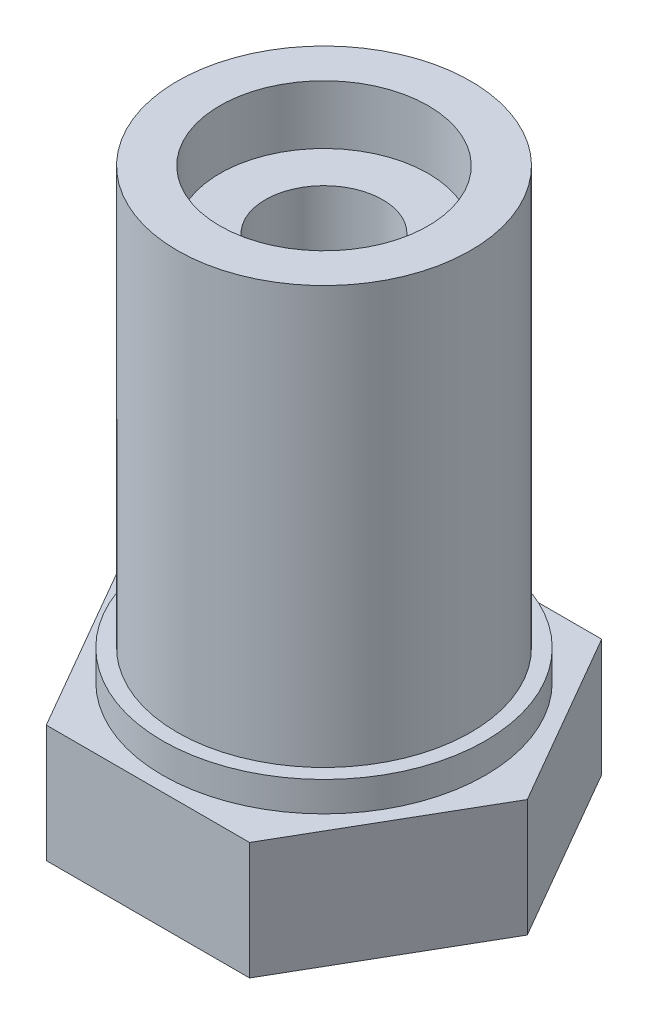
ISO-10303-21;
HEADER;
FILE_DESCRIPTION(('STEP AP214'),'2;1');
FILE_NAME('part.step','',(''),(''),'','','');
FILE_SCHEMA(('AUTOMOTIVE_DESIGN { 1 0 10303 214 1 1 1 1 }'));
ENDSEC;
DATA;
#1=APPLICATION_CONTEXT('core data for automotive mechanical design processes');
#2=APPLICATION_PROTOCOL_DEFINITION('international standard','automotive_design',2000,#1);
#3=PRODUCT_CONTEXT('',#1,'mechanical');
#4=PRODUCT('Part','Part','',(#3));
#5=PRODUCT_RELATED_PRODUCT_CATEGORY('part','',(#4));
#6=PRODUCT_DEFINITION_FORMATION('','',#4);
#7=PRODUCT_DEFINITION_CONTEXT('part definition',#1,'design');
#8=PRODUCT_DEFINITION('design','',#6,#7);
#9=PRODUCT_DEFINITION_SHAPE('','',#8);
#10=(LENGTH_UNIT() NAMED_UNIT(*) SI_UNIT(.MILLI.,.METRE.));
#11=(NAMED_UNIT(*) PLANE_ANGLE_UNIT() SI_UNIT($,.RADIAN.));
#12=(NAMED_UNIT(*) SI_UNIT($,.STERADIAN.) SOLID_ANGLE_UNIT());
#13=UNCERTAINTY_MEASURE_WITH_UNIT(LENGTH_MEASURE(1.E-05),#10,'distance_accuracy_value','');
#14=(GEOMETRIC_REPRESENTATION_CONTEXT(3) GLOBAL_UNCERTAINTY_ASSIGNED_CONTEXT((#13)) GLOBAL_UNIT_ASSIGNED_CONTEXT((#10,
#11,#12)) REPRESENTATION_CONTEXT('',''));
#15=CARTESIAN_POINT('',(0.,0.,0.));
#16=DIRECTION('',(0.,0.,1.));
#17=DIRECTION('',(1.,0.,0.));
#18=AXIS2_PLACEMENT_3D('',#15,#16,#17);
#19=CARTESIAN_POINT('',(0.,0.,0.));
#20=DIRECTION('',(0.,1.,0.));
#21=DIRECTION('',(0.,0.,1.));
#22=AXIS2_PLACEMENT_3D('',#19,#20,#21);
#23=CYLINDRICAL_SURFACE('',#22,2.000000064);
#24=CARTESIAN_POINT('',(0.,0.,0.));
#25=DIRECTION('',(0.,1.,0.));
#26=DIRECTION('',(0.,0.,1.));
#27=AXIS2_PLACEMENT_3D('',#24,#25,#26);
#28=CIRCLE('',#27,2.000000064);
#29=CARTESIAN_POINT('',(0.,0.,2.000000064));
#30=VERTEX_POINT('',#29);
#31=EDGE_CURVE('E194',#30,#30,#28,.T.);
#32=ORIENTED_EDGE('',*,*,#31,.F.);
#33=EDGE_LOOP('',(#32));
#34=FACE_BOUND('',#33,.T.);
#35=CARTESIAN_POINT('',(0.,17.24,0.));
#36=DIRECTION('',(0.,1.,0.));
#37=DIRECTION('',(0.,0.,1.));
#38=AXIS2_PLACEMENT_3D('',#35,#36,#37);
#39=CIRCLE('',#38,2.000000064);
#40=CARTESIAN_POINT('',(0.,17.24,2.000000064));
#41=VERTEX_POINT('',#40);
#42=EDGE_CURVE('E223',#41,#41,#39,.T.);
#43=ORIENTED_EDGE('',*,*,#42,.T.);
#44=EDGE_LOOP('',(#43));
#45=FACE_BOUND('',#44,.T.);
#46=ADVANCED_FACE('F41',(#34,#45),#23,.F.);
#47=CARTESIAN_POINT('',(6.92820323027551,4.,0.));
#48=DIRECTION('',(-0.866025403784438,0.,0.5));
#49=DIRECTION('',(0.5,0.,0.866025403784438));
#50=AXIS2_PLACEMENT_3D('',#47,#48,#49);
#51=PLANE('',#50);
#52=DIRECTION('',(-0.5,0.,-0.866025403784438));
#53=VECTOR('',#52,1.);
#54=CARTESIAN_POINT('',(6.92820323027551,0.,0.));
#55=LINE('',#54,#53);
#56=CARTESIAN_POINT('',(6.92820323027551,0.,0.));
#57=VERTEX_POINT('',#56);
#58=CARTESIAN_POINT('',(3.46410161513776,0.,-6.));
#59=VERTEX_POINT('',#58);
#60=EDGE_CURVE('E126',#57,#59,#55,.T.);
#61=ORIENTED_EDGE('',*,*,#60,.T.);
#62=DIRECTION('',(0.,-1.,0.));
#63=VECTOR('',#62,1.);
#64=CARTESIAN_POINT('',(3.46410161513776,4.,-6.));
#65=LINE('',#64,#63);
#66=CARTESIAN_POINT('',(3.46410161513776,4.,-6.));
#67=VERTEX_POINT('',#66);
#68=EDGE_CURVE('E11',#67,#59,#65,.T.);
#69=ORIENTED_EDGE('',*,*,#68,.F.);
#70=DIRECTION('',(-0.5,0.,-0.866025403784438));
#71=VECTOR('',#70,1.);
#72=CARTESIAN_POINT('',(6.92820323027551,4.,0.));
#73=LINE('',#72,#71);
#74=CARTESIAN_POINT('',(6.92820323027551,4.,0.));
#75=VERTEX_POINT('',#74);
#76=EDGE_CURVE('E137',#75,#67,#73,.T.);
#77=ORIENTED_EDGE('',*,*,#76,.F.);
#78=DIRECTION('',(0.,-1.,0.));
#79=VECTOR('',#78,1.);
#80=CARTESIAN_POINT('',(6.92820323027551,4.,0.));
#81=LINE('',#80,#79);
#82=EDGE_CURVE('E122',#75,#57,#81,.T.);
#83=ORIENTED_EDGE('',*,*,#82,.T.);
#84=EDGE_LOOP('',(#61,#69,#77,#83));
#85=FACE_BOUND('',#84,.T.);
#86=ADVANCED_FACE('F43',(#85),#51,.F.);
#87=CARTESIAN_POINT('',(3.46410161513776,4.,-6.));
#88=DIRECTION('',(0.,0.,1.));
#89=DIRECTION('',(1.,0.,0.));
#90=AXIS2_PLACEMENT_3D('',#87,#88,#89);
#91=PLANE('',#90);
#92=DIRECTION('',(-1.,0.,0.));
#93=VECTOR('',#92,1.);
#94=CARTESIAN_POINT('',(3.46410161513776,0.,-6.));
#95=LINE('',#94,#93);
#96=CARTESIAN_POINT('',(-3.46410161513776,0.,-6.));
#97=VERTEX_POINT('',#96);
#98=EDGE_CURVE('E129',#59,#97,#95,.T.);
#99=ORIENTED_EDGE('',*,*,#98,.T.);
#100=DIRECTION('',(0.,-1.,0.));
#101=VECTOR('',#100,1.);
#102=CARTESIAN_POINT('',(-3.46410161513776,4.,-6.));
#103=LINE('',#102,#101);
#104=CARTESIAN_POINT('',(-3.46410161513776,4.,-6.));
#105=VERTEX_POINT('',#104);
#106=EDGE_CURVE('E50',#105,#97,#103,.T.);
#107=ORIENTED_EDGE('',*,*,#106,.F.);
#108=DIRECTION('',(-1.,0.,0.));
#109=VECTOR('',#108,1.);
#110=CARTESIAN_POINT('',(3.46410161513776,4.,-6.));
#111=LINE('',#110,#109);
#112=EDGE_CURVE('E95',#67,#105,#111,.T.);
#113=ORIENTED_EDGE('',*,*,#112,.F.);
#114=ORIENTED_EDGE('',*,*,#68,.T.);
#115=EDGE_LOOP('',(#99,#107,#113,#114));
#116=FACE_BOUND('',#115,.T.);
#117=ADVANCED_FACE('F169',(#116),#91,.F.);
#118=CARTESIAN_POINT('',(-3.46410161513776,4.,-6.));
#119=DIRECTION('',(0.866025403784439,0.,0.5));
#120=DIRECTION('',(0.5,0.,-0.866025403784439));
#121=AXIS2_PLACEMENT_3D('',#118,#119,#120);
#122=PLANE('',#121);
#123=DIRECTION('',(-0.5,0.,0.866025403784439));
#124=VECTOR('',#123,1.);
#125=CARTESIAN_POINT('',(-3.46410161513776,0.,-6.));
#126=LINE('',#125,#124);
#127=CARTESIAN_POINT('',(-6.92820323027551,0.,0.));
#128=VERTEX_POINT('',#127);
#129=EDGE_CURVE('E132',#97,#128,#126,.T.);
#130=ORIENTED_EDGE('',*,*,#129,.T.);
#131=DIRECTION('',(0.,-1.,0.));
#132=VECTOR('',#131,1.);
#133=CARTESIAN_POINT('',(-6.92820323027551,4.,0.));
#134=LINE('',#133,#132);
#135=CARTESIAN_POINT('',(-6.92820323027551,4.,0.));
#136=VERTEX_POINT('',#135);
#137=EDGE_CURVE('E117',#136,#128,#134,.T.);
#138=ORIENTED_EDGE('',*,*,#137,.F.);
#139=DIRECTION('',(-0.5,0.,0.866025403784439));
#140=VECTOR('',#139,1.);
#141=CARTESIAN_POINT('',(-3.46410161513776,4.,-6.));
#142=LINE('',#141,#140);
#143=EDGE_CURVE('E108',#105,#136,#142,.T.);
#144=ORIENTED_EDGE('',*,*,#143,.F.);
#145=ORIENTED_EDGE('',*,*,#106,.T.);
#146=EDGE_LOOP('',(#130,#138,#144,#145));
#147=FACE_BOUND('',#146,.T.);
#148=ADVANCED_FACE('F143',(#147),#122,.F.);
#149=CARTESIAN_POINT('',(-6.92820323027551,4.,0.));
#150=DIRECTION('',(0.866025403784439,0.,-0.5));
#151=DIRECTION('',(-0.5,0.,-0.866025403784439));
#152=AXIS2_PLACEMENT_3D('',#149,#150,#151);
#153=PLANE('',#152);
#154=DIRECTION('',(0.5,0.,0.866025403784438));
#155=VECTOR('',#154,1.);
#156=CARTESIAN_POINT('',(-6.92820323027551,0.,0.));
#157=LINE('',#156,#155);
#158=CARTESIAN_POINT('',(-3.46410161513775,0.,6.));
#159=VERTEX_POINT('',#158);
#160=EDGE_CURVE('E116',#128,#159,#157,.T.);
#161=ORIENTED_EDGE('',*,*,#160,.T.);
#162=DIRECTION('',(0.,-1.,0.));
#163=VECTOR('',#162,1.);
#164=CARTESIAN_POINT('',(-3.46410161513775,4.,6.));
#165=LINE('',#164,#163);
#166=CARTESIAN_POINT('',(-3.46410161513775,4.,6.));
#167=VERTEX_POINT('',#166);
#168=EDGE_CURVE('E113',#167,#159,#165,.T.);
#169=ORIENTED_EDGE('',*,*,#168,.F.);
#170=DIRECTION('',(0.5,0.,0.866025403784438));
#171=VECTOR('',#170,1.);
#172=CARTESIAN_POINT('',(-6.92820323027551,4.,0.));
#173=LINE('',#172,#171);
#174=EDGE_CURVE('E102',#136,#167,#173,.T.);
#175=ORIENTED_EDGE('',*,*,#174,.F.);
#176=ORIENTED_EDGE('',*,*,#137,.T.);
#177=EDGE_LOOP('',(#161,#169,#175,#176));
#178=FACE_BOUND('',#177,.T.);
#179=ADVANCED_FACE('F114',(#178),#153,.F.);
#180=CARTESIAN_POINT('',(-3.46410161513775,4.,6.));
#181=DIRECTION('',(0.,0.,-1.));
#182=DIRECTION('',(-1.,0.,0.));
#183=AXIS2_PLACEMENT_3D('',#180,#181,#182);
#184=PLANE('',#183);
#185=DIRECTION('',(1.,0.,0.));
#186=VECTOR('',#185,1.);
#187=CARTESIAN_POINT('',(-3.46410161513775,0.,6.));
#188=LINE('',#187,#186);
#189=CARTESIAN_POINT('',(3.46410161513776,0.,6.));
#190=VERTEX_POINT('',#189);
#191=EDGE_CURVE('E81',#159,#190,#188,.T.);
#192=ORIENTED_EDGE('',*,*,#191,.T.);
#193=DIRECTION('',(0.,-1.,0.));
#194=VECTOR('',#193,1.);
#195=CARTESIAN_POINT('',(3.46410161513776,4.,6.));
#196=LINE('',#195,#194);
#197=CARTESIAN_POINT('',(3.46410161513776,4.,6.));
#198=VERTEX_POINT('',#197);
#199=EDGE_CURVE('E118',#198,#190,#196,.T.);
#200=ORIENTED_EDGE('',*,*,#199,.F.);
#201=DIRECTION('',(1.,0.,0.));
#202=VECTOR('',#201,1.);
#203=CARTESIAN_POINT('',(-3.46410161513775,4.,6.));
#204=LINE('',#203,#202);
#205=EDGE_CURVE('E106',#167,#198,#204,.T.);
#206=ORIENTED_EDGE('',*,*,#205,.F.);
#207=ORIENTED_EDGE('',*,*,#168,.T.);
#208=EDGE_LOOP('',(#192,#200,#206,#207));
#209=FACE_BOUND('',#208,.T.);
#210=ADVANCED_FACE('F120',(#209),#184,.F.);
#211=CARTESIAN_POINT('',(3.46410161513776,4.,6.));
#212=DIRECTION('',(-0.866025403784439,0.,-0.5));
#213=DIRECTION('',(-0.5,0.,0.866025403784439));
#214=AXIS2_PLACEMENT_3D('',#211,#212,#213);
#215=PLANE('',#214);
#216=DIRECTION('',(0.5,0.,-0.866025403784439));
#217=VECTOR('',#216,1.);
#218=CARTESIAN_POINT('',(3.46410161513776,0.,6.));
#219=LINE('',#218,#217);
#220=EDGE_CURVE('E87',#190,#57,#219,.T.);
#221=ORIENTED_EDGE('',*,*,#220,.T.);
#222=ORIENTED_EDGE('',*,*,#82,.F.);
#223=DIRECTION('',(0.5,0.,-0.866025403784439));
#224=VECTOR('',#223,1.);
#225=CARTESIAN_POINT('',(3.46410161513776,4.,6.));
#226=LINE('',#225,#224);
#227=EDGE_CURVE('E58',#198,#75,#226,.T.);
#228=ORIENTED_EDGE('',*,*,#227,.F.);
#229=ORIENTED_EDGE('',*,*,#199,.T.);
#230=EDGE_LOOP('',(#221,#222,#228,#229));
#231=FACE_BOUND('',#230,.T.);
#232=ADVANCED_FACE('F150',(#231),#215,.F.);
#233=CARTESIAN_POINT('',(0.,4.,0.));
#234=DIRECTION('',(0.,1.,0.));
#235=DIRECTION('',(0.,0.,1.));
#236=AXIS2_PLACEMENT_3D('',#233,#234,#235);
#237=PLANE('',#236);
#238=CARTESIAN_POINT('',(0.,4.,0.));
#239=DIRECTION('',(0.,1.,0.));
#240=DIRECTION('',(0.,0.,1.));
#241=AXIS2_PLACEMENT_3D('',#238,#239,#240);
#242=CIRCLE('',#241,5.500000049);
#243=CARTESIAN_POINT('',(0.,4.,5.500000049));
#244=VERTEX_POINT('',#243);
#245=EDGE_CURVE('E208',#244,#244,#242,.T.);
#246=ORIENTED_EDGE('',*,*,#245,.F.);
#247=EDGE_LOOP('',(#246));
#248=FACE_BOUND('',#247,.T.);
#249=ORIENTED_EDGE('',*,*,#76,.T.);
#250=ORIENTED_EDGE('',*,*,#112,.T.);
#251=ORIENTED_EDGE('',*,*,#143,.T.);
#252=ORIENTED_EDGE('',*,*,#174,.T.);
#253=ORIENTED_EDGE('',*,*,#205,.T.);
#254=ORIENTED_EDGE('',*,*,#227,.T.);
#255=EDGE_LOOP('',(#249,#250,#251,#252,#253,#254));
#256=FACE_BOUND('',#255,.T.);
#257=ADVANCED_FACE('F104',(#248,#256),#237,.T.);
#258=CARTESIAN_POINT('',(0.,0.,0.));
#259=DIRECTION('',(0.,1.,0.));
#260=DIRECTION('',(0.,0.,1.));
#261=AXIS2_PLACEMENT_3D('',#258,#259,#260);
#262=PLANE('',#261);
#263=ORIENTED_EDGE('',*,*,#31,.T.);
#264=EDGE_LOOP('',(#263));
#265=FACE_BOUND('',#264,.T.);
#266=ORIENTED_EDGE('',*,*,#60,.F.);
#267=ORIENTED_EDGE('',*,*,#220,.F.);
#268=ORIENTED_EDGE('',*,*,#191,.F.);
#269=ORIENTED_EDGE('',*,*,#160,.F.);
#270=ORIENTED_EDGE('',*,*,#129,.F.);
#271=ORIENTED_EDGE('',*,*,#98,.F.);
#272=EDGE_LOOP('',(#266,#267,#268,#269,#270,#271));
#273=FACE_BOUND('',#272,.T.);
#274=ADVANCED_FACE('F146',(#265,#273),#262,.F.);
#275=CARTESIAN_POINT('',(0.,5.016,0.));
#276=DIRECTION('',(0.,1.,0.));
#277=DIRECTION('',(0.,0.,1.));
#278=AXIS2_PLACEMENT_3D('',#275,#276,#277);
#279=PLANE('',#278);
#280=CARTESIAN_POINT('',(0.,5.016,0.));
#281=DIRECTION('',(0.,1.,0.));
#282=DIRECTION('',(0.,0.,1.));
#283=AXIS2_PLACEMENT_3D('',#280,#281,#282);
#284=CIRCLE('',#283,5.500000049);
#285=CARTESIAN_POINT('',(0.,5.016,5.500000049));
#286=VERTEX_POINT('',#285);
#287=EDGE_CURVE('E130',#286,#286,#284,.T.);
#288=ORIENTED_EDGE('',*,*,#287,.T.);
#289=EDGE_LOOP('',(#288));
#290=FACE_BOUND('',#289,.T.);
#291=CARTESIAN_POINT('',(0.,5.016,0.));
#292=DIRECTION('',(0.,1.,0.));
#293=DIRECTION('',(0.,0.,1.));
#294=AXIS2_PLACEMENT_3D('',#291,#292,#293);
#295=CIRCLE('',#294,5.000000033);
#296=CARTESIAN_POINT('',(0.,5.016,5.000000033));
#297=VERTEX_POINT('',#296);
#298=EDGE_CURVE('E199',#297,#297,#295,.T.);
#299=ORIENTED_EDGE('',*,*,#298,.F.);
#300=EDGE_LOOP('',(#299));
#301=FACE_BOUND('',#300,.T.);
#302=ADVANCED_FACE('F184',(#290,#301),#279,.T.);
#303=CARTESIAN_POINT('',(0.,5.016,0.));
#304=DIRECTION('',(0.,-1.,0.));
#305=DIRECTION('',(0.,0.,-1.));
#306=AXIS2_PLACEMENT_3D('',#303,#304,#305);
#307=CYLINDRICAL_SURFACE('',#306,5.500000049);
#308=ORIENTED_EDGE('',*,*,#287,.F.);
#309=EDGE_LOOP('',(#308));
#310=FACE_BOUND('',#309,.T.);
#311=ORIENTED_EDGE('',*,*,#245,.T.);
#312=EDGE_LOOP('',(#311));
#313=FACE_BOUND('',#312,.T.);
#314=ADVANCED_FACE('F182',(#310,#313),#307,.T.);
#315=CARTESIAN_POINT('',(0.,19.24,0.));
#316=DIRECTION('',(0.,-1.,0.));
#317=DIRECTION('',(0.,0.,-1.));
#318=AXIS2_PLACEMENT_3D('',#315,#316,#317);
#319=CYLINDRICAL_SURFACE('',#318,5.000000033);
#320=ORIENTED_EDGE('',*,*,#298,.T.);
#321=EDGE_LOOP('',(#320));
#322=FACE_BOUND('',#321,.T.);
#323=CARTESIAN_POINT('',(0.,19.24,0.));
#324=DIRECTION('',(0.,1.,0.));
#325=DIRECTION('',(0.,0.,1.));
#326=AXIS2_PLACEMENT_3D('',#323,#324,#325);
#327=CIRCLE('',#326,5.000000033);
#328=CARTESIAN_POINT('',(0.,19.24,5.000000033));
#329=VERTEX_POINT('',#328);
#330=EDGE_CURVE('E195',#329,#329,#327,.T.);
#331=ORIENTED_EDGE('',*,*,#330,.F.);
#332=EDGE_LOOP('',(#331));
#333=FACE_BOUND('',#332,.T.);
#334=ADVANCED_FACE('F178',(#322,#333),#319,.T.);
#335=CARTESIAN_POINT('',(0.,19.24,0.));
#336=DIRECTION('',(0.,1.,0.));
#337=DIRECTION('',(0.,0.,1.));
#338=AXIS2_PLACEMENT_3D('',#335,#336,#337);
#339=PLANE('',#338);
#340=CARTESIAN_POINT('',(0.,19.24,0.));
#341=DIRECTION('',(0.,1.,0.));
#342=DIRECTION('',(0.,0.,1.));
#343=AXIS2_PLACEMENT_3D('',#340,#341,#342);
#344=CIRCLE('',#343,3.55);
#345=CARTESIAN_POINT('',(0.,19.24,3.55));
#346=VERTEX_POINT('',#345);
#347=EDGE_CURVE('E202',#346,#346,#344,.T.);
#348=ORIENTED_EDGE('',*,*,#347,.F.);
#349=EDGE_LOOP('',(#348));
#350=FACE_BOUND('',#349,.T.);
#351=ORIENTED_EDGE('',*,*,#330,.T.);
#352=EDGE_LOOP('',(#351));
#353=FACE_BOUND('',#352,.T.);
#354=ADVANCED_FACE('F176',(#350,#353),#339,.T.);
#355=CARTESIAN_POINT('',(0.,17.24,0.));
#356=DIRECTION('',(0.,1.,0.));
#357=DIRECTION('',(0.,0.,1.));
#358=AXIS2_PLACEMENT_3D('',#355,#356,#357);
#359=CYLINDRICAL_SURFACE('',#358,3.55);
#360=CARTESIAN_POINT('',(0.,17.24,0.));
#361=DIRECTION('',(0.,1.,0.));
#362=DIRECTION('',(0.,0.,1.));
#363=AXIS2_PLACEMENT_3D('',#360,#361,#362);
#364=CIRCLE('',#363,3.55);
#365=CARTESIAN_POINT('',(0.,17.24,3.55));
#366=VERTEX_POINT('',#365);
#367=EDGE_CURVE('E196',#366,#366,#364,.T.);
#368=ORIENTED_EDGE('',*,*,#367,.F.);
#369=EDGE_LOOP('',(#368));
#370=FACE_BOUND('',#369,.T.);
#371=ORIENTED_EDGE('',*,*,#347,.T.);
#372=EDGE_LOOP('',(#371));
#373=FACE_BOUND('',#372,.T.);
#374=ADVANCED_FACE('F174',(#370,#373),#359,.F.);
#375=CARTESIAN_POINT('',(0.,17.24,0.));
#376=DIRECTION('',(0.,1.,0.));
#377=DIRECTION('',(0.,0.,1.));
#378=AXIS2_PLACEMENT_3D('',#375,#376,#377);
#379=PLANE('',#378);
#380=ORIENTED_EDGE('',*,*,#42,.F.);
#381=EDGE_LOOP('',(#380));
#382=FACE_BOUND('',#381,.T.);
#383=ORIENTED_EDGE('',*,*,#367,.T.);
#384=EDGE_LOOP('',(#383));
#385=FACE_BOUND('',#384,.T.);
#386=ADVANCED_FACE('F228',(#382,#385),#379,.T.);
#387=CLOSED_SHELL('',(#46,#86,#117,#148,#179,#210,#232,#257,#274,#302,#314,#334,#354,#374,#386));
#388=MANIFOLD_SOLID_BREP('B2',#387);
#389=ADVANCED_BREP_SHAPE_REPRESENTATION('',(#18,#388),#14);
#390=SHAPE_DEFINITION_REPRESENTATION(#9,#389);
ENDSEC;
END-ISO-10303-21;
